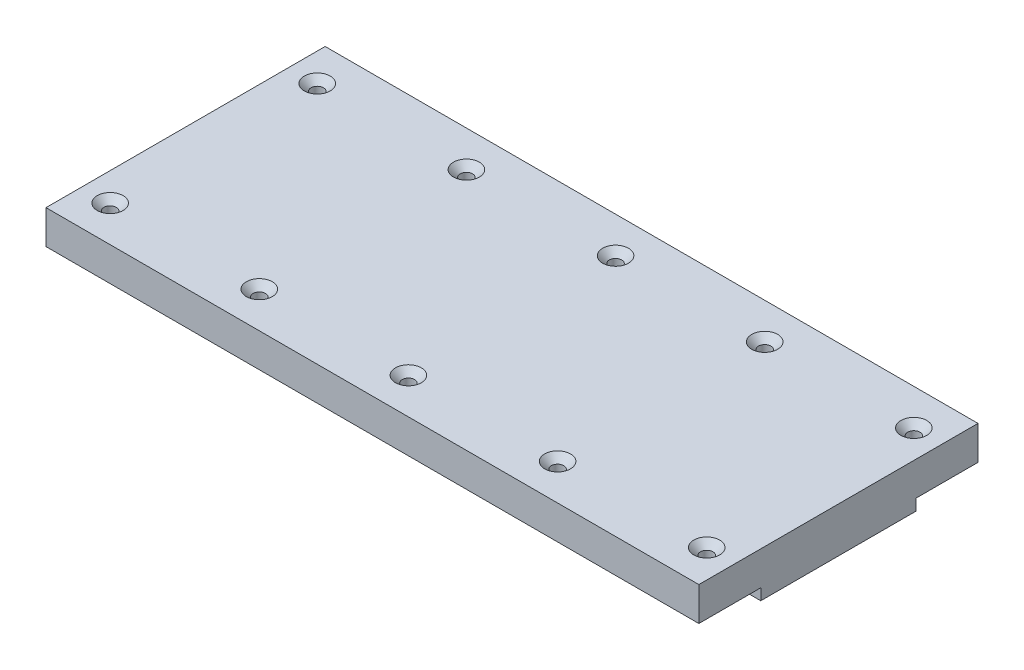
ISO-10303-21;
HEADER;
FILE_DESCRIPTION(('STEP AP214'),'2;1');
FILE_NAME('part.step','',(''),(''),'','','');
FILE_SCHEMA(('AUTOMOTIVE_DESIGN { 1 0 10303 214 1 1 1 1 }'));
ENDSEC;
DATA;
#1=APPLICATION_CONTEXT('core data for automotive mechanical design processes');
#2=APPLICATION_PROTOCOL_DEFINITION('international standard','automotive_design',2000,#1);
#3=PRODUCT_CONTEXT('',#1,'mechanical');
#4=PRODUCT('Part','Part','',(#3));
#5=PRODUCT_RELATED_PRODUCT_CATEGORY('part','',(#4));
#6=PRODUCT_DEFINITION_FORMATION('','',#4);
#7=PRODUCT_DEFINITION_CONTEXT('part definition',#1,'design');
#8=PRODUCT_DEFINITION('design','',#6,#7);
#9=PRODUCT_DEFINITION_SHAPE('','',#8);
#10=(LENGTH_UNIT() NAMED_UNIT(*) SI_UNIT(.MILLI.,.METRE.));
#11=(NAMED_UNIT(*) PLANE_ANGLE_UNIT() SI_UNIT($,.RADIAN.));
#12=(NAMED_UNIT(*) SI_UNIT($,.STERADIAN.) SOLID_ANGLE_UNIT());
#13=UNCERTAINTY_MEASURE_WITH_UNIT(LENGTH_MEASURE(1.E-05),#10,'distance_accuracy_value','');
#14=(GEOMETRIC_REPRESENTATION_CONTEXT(3) GLOBAL_UNCERTAINTY_ASSIGNED_CONTEXT((#13)) GLOBAL_UNIT_ASSIGNED_CONTEXT((#10,
#11,#12)) REPRESENTATION_CONTEXT('',''));
#15=CARTESIAN_POINT('',(0.,0.,0.));
#16=DIRECTION('',(0.,0.,1.));
#17=DIRECTION('',(1.,0.,0.));
#18=AXIS2_PLACEMENT_3D('',#15,#16,#17);
#19=CARTESIAN_POINT('',(-580.,0.,69.));
#20=DIRECTION('',(0.,0.,1.));
#21=DIRECTION('',(1.,0.,0.));
#22=AXIS2_PLACEMENT_3D('',#19,#20,#21);
#23=PLANE('',#22);
#24=DIRECTION('',(0.,-1.,0.));
#25=VECTOR('',#24,1.);
#26=CARTESIAN_POINT('',(0.,0.,69.));
#27=LINE('',#26,#25);
#28=CARTESIAN_POINT('',(0.,0.,69.));
#29=VERTEX_POINT('',#28);
#30=CARTESIAN_POINT('',(0.,-10.,69.));
#31=VERTEX_POINT('',#30);
#32=EDGE_CURVE('E136',#29,#31,#27,.T.);
#33=ORIENTED_EDGE('',*,*,#32,.F.);
#34=DIRECTION('',(1.,0.,0.));
#35=VECTOR('',#34,1.);
#36=CARTESIAN_POINT('',(-580.,0.,69.));
#37=LINE('',#36,#35);
#38=CARTESIAN_POINT('',(-580.,0.,69.));
#39=VERTEX_POINT('',#38);
#40=EDGE_CURVE('E53',#39,#29,#37,.T.);
#41=ORIENTED_EDGE('',*,*,#40,.F.);
#42=DIRECTION('',(0.,-1.,0.));
#43=VECTOR('',#42,1.);
#44=CARTESIAN_POINT('',(-580.,0.,69.));
#45=LINE('',#44,#43);
#46=CARTESIAN_POINT('',(-580.,-10.,69.));
#47=VERTEX_POINT('',#46);
#48=EDGE_CURVE('E158',#39,#47,#45,.T.);
#49=ORIENTED_EDGE('',*,*,#48,.T.);
#50=DIRECTION('',(1.,0.,0.));
#51=VECTOR('',#50,1.);
#52=CARTESIAN_POINT('',(-580.,-10.,69.));
#53=LINE('',#52,#51);
#54=EDGE_CURVE('E94',#47,#31,#53,.T.);
#55=ORIENTED_EDGE('',*,*,#54,.T.);
#56=EDGE_LOOP('',(#33,#41,#49,#55));
#57=FACE_BOUND('',#56,.T.);
#58=ADVANCED_FACE('F35',(#57),#23,.T.);
#59=CARTESIAN_POINT('',(-580.,0.,124.));
#60=DIRECTION('',(0.,-1.,0.));
#61=DIRECTION('',(0.,0.,-1.));
#62=AXIS2_PLACEMENT_3D('',#59,#60,#61);
#63=PLANE('',#62);
#64=CARTESIAN_POINT('',(-290.,0.,92.0000000000001));
#65=DIRECTION('',(0.,-1.,0.));
#66=DIRECTION('',(0.,0.,-1.));
#67=AXIS2_PLACEMENT_3D('',#64,#65,#66);
#68=CIRCLE('',#67,5.49999999999996);
#69=CARTESIAN_POINT('',(-290.,0.,86.5000000000001));
#70=VERTEX_POINT('',#69);
#71=EDGE_CURVE('E548',#70,#70,#68,.F.);
#72=ORIENTED_EDGE('',*,*,#71,.T.);
#73=EDGE_LOOP('',(#72));
#74=FACE_BOUND('',#73,.T.);
#75=CARTESIAN_POINT('',(-157.5,0.,92.0000000000001));
#76=DIRECTION('',(0.,-1.,0.));
#77=DIRECTION('',(0.,0.,-1.));
#78=AXIS2_PLACEMENT_3D('',#75,#76,#77);
#79=CIRCLE('',#78,5.49999999999996);
#80=CARTESIAN_POINT('',(-157.5,0.,86.5000000000001));
#81=VERTEX_POINT('',#80);
#82=EDGE_CURVE('E553',#81,#81,#79,.F.);
#83=ORIENTED_EDGE('',*,*,#82,.T.);
#84=EDGE_LOOP('',(#83));
#85=FACE_BOUND('',#84,.T.);
#86=CARTESIAN_POINT('',(-555.,0.,92.0000000000001));
#87=DIRECTION('',(0.,-1.,0.));
#88=DIRECTION('',(0.,0.,-1.));
#89=AXIS2_PLACEMENT_3D('',#86,#87,#88);
#90=CIRCLE('',#89,5.49999999999996);
#91=CARTESIAN_POINT('',(-555.,0.,86.5000000000001));
#92=VERTEX_POINT('',#91);
#93=EDGE_CURVE('E325',#92,#92,#90,.F.);
#94=ORIENTED_EDGE('',*,*,#93,.T.);
#95=EDGE_LOOP('',(#94));
#96=FACE_BOUND('',#95,.T.);
#97=CARTESIAN_POINT('',(-422.5,0.,92.0000000000001));
#98=DIRECTION('',(0.,-1.,0.));
#99=DIRECTION('',(0.,0.,-1.));
#100=AXIS2_PLACEMENT_3D('',#97,#98,#99);
#101=CIRCLE('',#100,5.49999999999996);
#102=CARTESIAN_POINT('',(-422.5,0.,86.5000000000001));
#103=VERTEX_POINT('',#102);
#104=EDGE_CURVE('E326',#103,#103,#101,.F.);
#105=ORIENTED_EDGE('',*,*,#104,.T.);
#106=EDGE_LOOP('',(#105));
#107=FACE_BOUND('',#106,.T.);
#108=CARTESIAN_POINT('',(-24.9999999999999,0.,92.0000000000001));
#109=DIRECTION('',(0.,-1.,0.));
#110=DIRECTION('',(0.,0.,-1.));
#111=AXIS2_PLACEMENT_3D('',#108,#109,#110);
#112=CIRCLE('',#111,5.49999999999996);
#113=CARTESIAN_POINT('',(-24.9999999999999,0.,86.5000000000001));
#114=VERTEX_POINT('',#113);
#115=EDGE_CURVE('E559',#114,#114,#112,.F.);
#116=ORIENTED_EDGE('',*,*,#115,.T.);
#117=EDGE_LOOP('',(#116));
#118=FACE_BOUND('',#117,.T.);
#119=DIRECTION('',(0.,0.,-1.));
#120=VECTOR('',#119,1.);
#121=CARTESIAN_POINT('',(0.,0.,124.));
#122=LINE('',#121,#120);
#123=CARTESIAN_POINT('',(0.,0.,124.));
#124=VERTEX_POINT('',#123);
#125=EDGE_CURVE('E155',#124,#29,#122,.T.);
#126=ORIENTED_EDGE('',*,*,#125,.F.);
#127=DIRECTION('',(1.,0.,0.));
#128=VECTOR('',#127,1.);
#129=CARTESIAN_POINT('',(-580.,0.,124.));
#130=LINE('',#129,#128);
#131=CARTESIAN_POINT('',(-580.,0.,124.));
#132=VERTEX_POINT('',#131);
#133=EDGE_CURVE('E82',#132,#124,#130,.T.);
#134=ORIENTED_EDGE('',*,*,#133,.F.);
#135=DIRECTION('',(0.,0.,-1.));
#136=VECTOR('',#135,1.);
#137=CARTESIAN_POINT('',(-580.,0.,124.));
#138=LINE('',#137,#136);
#139=EDGE_CURVE('E126',#132,#39,#138,.T.);
#140=ORIENTED_EDGE('',*,*,#139,.T.);
#141=ORIENTED_EDGE('',*,*,#40,.T.);
#142=EDGE_LOOP('',(#126,#134,#140,#141));
#143=FACE_BOUND('',#142,.T.);
#144=ADVANCED_FACE('F243',(#74,#85,#96,#107,#118,#143),#63,.T.);
#145=CARTESIAN_POINT('',(-580.,30.,124.));
#146=DIRECTION('',(0.,0.,1.));
#147=DIRECTION('',(1.,0.,0.));
#148=AXIS2_PLACEMENT_3D('',#145,#146,#147);
#149=PLANE('',#148);
#150=DIRECTION('',(0.,-1.,0.));
#151=VECTOR('',#150,1.);
#152=CARTESIAN_POINT('',(0.,30.,124.));
#153=LINE('',#152,#151);
#154=CARTESIAN_POINT('',(0.,30.,124.));
#155=VERTEX_POINT('',#154);
#156=EDGE_CURVE('E113',#155,#124,#153,.T.);
#157=ORIENTED_EDGE('',*,*,#156,.F.);
#158=DIRECTION('',(1.,0.,0.));
#159=VECTOR('',#158,1.);
#160=CARTESIAN_POINT('',(-580.,30.,124.));
#161=LINE('',#160,#159);
#162=CARTESIAN_POINT('',(-580.,30.,124.));
#163=VERTEX_POINT('',#162);
#164=EDGE_CURVE('E108',#163,#155,#161,.T.);
#165=ORIENTED_EDGE('',*,*,#164,.F.);
#166=DIRECTION('',(0.,-1.,0.));
#167=VECTOR('',#166,1.);
#168=CARTESIAN_POINT('',(-580.,30.,124.));
#169=LINE('',#168,#167);
#170=EDGE_CURVE('E111',#163,#132,#169,.T.);
#171=ORIENTED_EDGE('',*,*,#170,.T.);
#172=ORIENTED_EDGE('',*,*,#133,.T.);
#173=EDGE_LOOP('',(#157,#165,#171,#172));
#174=FACE_BOUND('',#173,.T.);
#175=ADVANCED_FACE('F110',(#174),#149,.T.);
#176=CARTESIAN_POINT('',(-580.,30.,-124.));
#177=DIRECTION('',(0.,1.,0.));
#178=DIRECTION('',(0.,0.,1.));
#179=AXIS2_PLACEMENT_3D('',#176,#177,#178);
#180=PLANE('',#179);
#181=CARTESIAN_POINT('',(-24.9999999999999,30.,92.0000000000001));
#182=DIRECTION('',(0.,1.,0.));
#183=DIRECTION('',(0.,0.,1.));
#184=AXIS2_PLACEMENT_3D('',#181,#182,#183);
#185=CIRCLE('',#184,11.5000000000001);
#186=CARTESIAN_POINT('',(-24.9999999999999,30.,103.5));
#187=VERTEX_POINT('',#186);
#188=EDGE_CURVE('E199',#187,#187,#185,.F.);
#189=ORIENTED_EDGE('',*,*,#188,.T.);
#190=EDGE_LOOP('',(#189));
#191=FACE_BOUND('',#190,.T.);
#192=CARTESIAN_POINT('',(-24.9999999999999,30.,-91.9999999999999));
#193=DIRECTION('',(0.,1.,0.));
#194=DIRECTION('',(0.,0.,1.));
#195=AXIS2_PLACEMENT_3D('',#192,#193,#194);
#196=CIRCLE('',#195,11.5000000000001);
#197=CARTESIAN_POINT('',(-24.9999999999999,30.,-80.4999999999998));
#198=VERTEX_POINT('',#197);
#199=EDGE_CURVE('E196',#198,#198,#196,.F.);
#200=ORIENTED_EDGE('',*,*,#199,.T.);
#201=EDGE_LOOP('',(#200));
#202=FACE_BOUND('',#201,.T.);
#203=CARTESIAN_POINT('',(-157.5,30.,-91.9999999999999));
#204=DIRECTION('',(0.,1.,0.));
#205=DIRECTION('',(0.,0.,1.));
#206=AXIS2_PLACEMENT_3D('',#203,#204,#205);
#207=CIRCLE('',#206,11.5000000000001);
#208=CARTESIAN_POINT('',(-157.5,30.,-80.4999999999998));
#209=VERTEX_POINT('',#208);
#210=EDGE_CURVE('E193',#209,#209,#207,.F.);
#211=ORIENTED_EDGE('',*,*,#210,.T.);
#212=EDGE_LOOP('',(#211));
#213=FACE_BOUND('',#212,.T.);
#214=CARTESIAN_POINT('',(-157.5,30.,92.0000000000001));
#215=DIRECTION('',(0.,1.,0.));
#216=DIRECTION('',(0.,0.,1.));
#217=AXIS2_PLACEMENT_3D('',#214,#215,#216);
#218=CIRCLE('',#217,11.5000000000001);
#219=CARTESIAN_POINT('',(-157.5,30.,103.5));
#220=VERTEX_POINT('',#219);
#221=EDGE_CURVE('E190',#220,#220,#218,.F.);
#222=ORIENTED_EDGE('',*,*,#221,.T.);
#223=EDGE_LOOP('',(#222));
#224=FACE_BOUND('',#223,.T.);
#225=CARTESIAN_POINT('',(-290.,30.,-91.9999999999999));
#226=DIRECTION('',(0.,1.,0.));
#227=DIRECTION('',(0.,0.,1.));
#228=AXIS2_PLACEMENT_3D('',#225,#226,#227);
#229=CIRCLE('',#228,11.5000000000001);
#230=CARTESIAN_POINT('',(-290.,30.,-80.4999999999998));
#231=VERTEX_POINT('',#230);
#232=EDGE_CURVE('E187',#231,#231,#229,.F.);
#233=ORIENTED_EDGE('',*,*,#232,.T.);
#234=EDGE_LOOP('',(#233));
#235=FACE_BOUND('',#234,.T.);
#236=CARTESIAN_POINT('',(-290.,30.,92.0000000000001));
#237=DIRECTION('',(0.,1.,0.));
#238=DIRECTION('',(0.,0.,1.));
#239=AXIS2_PLACEMENT_3D('',#236,#237,#238);
#240=CIRCLE('',#239,11.5000000000001);
#241=CARTESIAN_POINT('',(-290.,30.,103.5));
#242=VERTEX_POINT('',#241);
#243=EDGE_CURVE('E184',#242,#242,#240,.F.);
#244=ORIENTED_EDGE('',*,*,#243,.T.);
#245=EDGE_LOOP('',(#244));
#246=FACE_BOUND('',#245,.T.);
#247=CARTESIAN_POINT('',(-422.5,30.,-91.9999999999999));
#248=DIRECTION('',(0.,1.,0.));
#249=DIRECTION('',(0.,0.,1.));
#250=AXIS2_PLACEMENT_3D('',#247,#248,#249);
#251=CIRCLE('',#250,11.5000000000001);
#252=CARTESIAN_POINT('',(-422.5,30.,-80.4999999999998));
#253=VERTEX_POINT('',#252);
#254=EDGE_CURVE('E181',#253,#253,#251,.F.);
#255=ORIENTED_EDGE('',*,*,#254,.T.);
#256=EDGE_LOOP('',(#255));
#257=FACE_BOUND('',#256,.T.);
#258=CARTESIAN_POINT('',(-555.,30.,-91.9999999999999));
#259=DIRECTION('',(0.,1.,0.));
#260=DIRECTION('',(0.,0.,1.));
#261=AXIS2_PLACEMENT_3D('',#258,#259,#260);
#262=CIRCLE('',#261,11.5000000000001);
#263=CARTESIAN_POINT('',(-555.,30.,-80.4999999999998));
#264=VERTEX_POINT('',#263);
#265=EDGE_CURVE('E178',#264,#264,#262,.F.);
#266=ORIENTED_EDGE('',*,*,#265,.T.);
#267=EDGE_LOOP('',(#266));
#268=FACE_BOUND('',#267,.T.);
#269=CARTESIAN_POINT('',(-555.,30.,92.0000000000001));
#270=DIRECTION('',(0.,1.,0.));
#271=DIRECTION('',(0.,0.,1.));
#272=AXIS2_PLACEMENT_3D('',#269,#270,#271);
#273=CIRCLE('',#272,11.5000000000001);
#274=CARTESIAN_POINT('',(-555.,30.,103.5));
#275=VERTEX_POINT('',#274);
#276=EDGE_CURVE('E175',#275,#275,#273,.F.);
#277=ORIENTED_EDGE('',*,*,#276,.T.);
#278=EDGE_LOOP('',(#277));
#279=FACE_BOUND('',#278,.T.);
#280=CARTESIAN_POINT('',(-422.5,30.,92.0000000000001));
#281=DIRECTION('',(0.,1.,0.));
#282=DIRECTION('',(0.,0.,1.));
#283=AXIS2_PLACEMENT_3D('',#280,#281,#282);
#284=CIRCLE('',#283,11.5000000000001);
#285=CARTESIAN_POINT('',(-422.5,30.,103.5));
#286=VERTEX_POINT('',#285);
#287=EDGE_CURVE('E172',#286,#286,#284,.F.);
#288=ORIENTED_EDGE('',*,*,#287,.T.);
#289=EDGE_LOOP('',(#288));
#290=FACE_BOUND('',#289,.T.);
#291=DIRECTION('',(0.,0.,1.));
#292=VECTOR('',#291,1.);
#293=CARTESIAN_POINT('',(0.,30.,-124.));
#294=LINE('',#293,#292);
#295=CARTESIAN_POINT('',(0.,30.,-124.));
#296=VERTEX_POINT('',#295);
#297=EDGE_CURVE('E152',#296,#155,#294,.T.);
#298=ORIENTED_EDGE('',*,*,#297,.F.);
#299=DIRECTION('',(1.,0.,0.));
#300=VECTOR('',#299,1.);
#301=CARTESIAN_POINT('',(-580.,30.,-124.));
#302=LINE('',#301,#300);
#303=CARTESIAN_POINT('',(-580.,30.,-124.));
#304=VERTEX_POINT('',#303);
#305=EDGE_CURVE('E118',#304,#296,#302,.T.);
#306=ORIENTED_EDGE('',*,*,#305,.F.);
#307=DIRECTION('',(0.,0.,1.));
#308=VECTOR('',#307,1.);
#309=CARTESIAN_POINT('',(-580.,30.,-124.));
#310=LINE('',#309,#308);
#311=EDGE_CURVE('E124',#304,#163,#310,.T.);
#312=ORIENTED_EDGE('',*,*,#311,.T.);
#313=ORIENTED_EDGE('',*,*,#164,.T.);
#314=EDGE_LOOP('',(#298,#306,#312,#313));
#315=FACE_BOUND('',#314,.T.);
#316=ADVANCED_FACE('F128',(#191,#202,#213,#224,#235,#246,#257,#268,#279,#290,#315),#180,.T.);
#317=CARTESIAN_POINT('',(-580.,0.,-124.));
#318=DIRECTION('',(0.,0.,-1.));
#319=DIRECTION('',(-1.,0.,0.));
#320=AXIS2_PLACEMENT_3D('',#317,#318,#319);
#321=PLANE('',#320);
#322=DIRECTION('',(0.,1.,0.));
#323=VECTOR('',#322,1.);
#324=CARTESIAN_POINT('',(0.,0.,-124.));
#325=LINE('',#324,#323);
#326=CARTESIAN_POINT('',(0.,0.,-124.));
#327=VERTEX_POINT('',#326);
#328=EDGE_CURVE('E149',#327,#296,#325,.T.);
#329=ORIENTED_EDGE('',*,*,#328,.F.);
#330=DIRECTION('',(1.,0.,0.));
#331=VECTOR('',#330,1.);
#332=CARTESIAN_POINT('',(-580.,0.,-124.));
#333=LINE('',#332,#331);
#334=CARTESIAN_POINT('',(-580.,0.,-124.));
#335=VERTEX_POINT('',#334);
#336=EDGE_CURVE('E163',#335,#327,#333,.T.);
#337=ORIENTED_EDGE('',*,*,#336,.F.);
#338=DIRECTION('',(0.,1.,0.));
#339=VECTOR('',#338,1.);
#340=CARTESIAN_POINT('',(-580.,0.,-124.));
#341=LINE('',#340,#339);
#342=EDGE_CURVE('E129',#335,#304,#341,.T.);
#343=ORIENTED_EDGE('',*,*,#342,.T.);
#344=ORIENTED_EDGE('',*,*,#305,.T.);
#345=EDGE_LOOP('',(#329,#337,#343,#344));
#346=FACE_BOUND('',#345,.T.);
#347=ADVANCED_FACE('F355',(#346),#321,.T.);
#348=CARTESIAN_POINT('',(-580.,0.,-69.));
#349=DIRECTION('',(0.,-1.,0.));
#350=DIRECTION('',(0.,0.,-1.));
#351=AXIS2_PLACEMENT_3D('',#348,#349,#350);
#352=PLANE('',#351);
#353=CARTESIAN_POINT('',(-157.5,0.,-91.9999999999999));
#354=DIRECTION('',(0.,-1.,0.));
#355=DIRECTION('',(0.,0.,-1.));
#356=AXIS2_PLACEMENT_3D('',#353,#354,#355);
#357=CIRCLE('',#356,5.49999999999996);
#358=CARTESIAN_POINT('',(-157.5,0.,-97.4999999999999));
#359=VERTEX_POINT('',#358);
#360=EDGE_CURVE('E549',#359,#359,#357,.F.);
#361=ORIENTED_EDGE('',*,*,#360,.T.);
#362=EDGE_LOOP('',(#361));
#363=FACE_BOUND('',#362,.T.);
#364=CARTESIAN_POINT('',(-24.9999999999999,0.,-91.9999999999999));
#365=DIRECTION('',(0.,-1.,0.));
#366=DIRECTION('',(0.,0.,-1.));
#367=AXIS2_PLACEMENT_3D('',#364,#365,#366);
#368=CIRCLE('',#367,5.49999999999996);
#369=CARTESIAN_POINT('',(-24.9999999999999,0.,-97.4999999999999));
#370=VERTEX_POINT('',#369);
#371=EDGE_CURVE('E556',#370,#370,#368,.F.);
#372=ORIENTED_EDGE('',*,*,#371,.T.);
#373=EDGE_LOOP('',(#372));
#374=FACE_BOUND('',#373,.T.);
#375=CARTESIAN_POINT('',(-422.5,0.,-91.9999999999999));
#376=DIRECTION('',(0.,-1.,0.));
#377=DIRECTION('',(0.,0.,-1.));
#378=AXIS2_PLACEMENT_3D('',#375,#376,#377);
#379=CIRCLE('',#378,5.49999999999996);
#380=CARTESIAN_POINT('',(-422.5,0.,-97.4999999999999));
#381=VERTEX_POINT('',#380);
#382=EDGE_CURVE('E323',#381,#381,#379,.F.);
#383=ORIENTED_EDGE('',*,*,#382,.T.);
#384=EDGE_LOOP('',(#383));
#385=FACE_BOUND('',#384,.T.);
#386=CARTESIAN_POINT('',(-290.,0.,-91.9999999999999));
#387=DIRECTION('',(0.,-1.,0.));
#388=DIRECTION('',(0.,0.,-1.));
#389=AXIS2_PLACEMENT_3D('',#386,#387,#388);
#390=CIRCLE('',#389,5.49999999999996);
#391=CARTESIAN_POINT('',(-290.,0.,-97.4999999999999));
#392=VERTEX_POINT('',#391);
#393=EDGE_CURVE('E331',#392,#392,#390,.F.);
#394=ORIENTED_EDGE('',*,*,#393,.T.);
#395=EDGE_LOOP('',(#394));
#396=FACE_BOUND('',#395,.T.);
#397=CARTESIAN_POINT('',(-555.,0.,-91.9999999999999));
#398=DIRECTION('',(0.,-1.,0.));
#399=DIRECTION('',(0.,0.,-1.));
#400=AXIS2_PLACEMENT_3D('',#397,#398,#399);
#401=CIRCLE('',#400,5.49999999999996);
#402=CARTESIAN_POINT('',(-555.,0.,-97.4999999999999));
#403=VERTEX_POINT('',#402);
#404=EDGE_CURVE('E140',#403,#403,#401,.F.);
#405=ORIENTED_EDGE('',*,*,#404,.T.);
#406=EDGE_LOOP('',(#405));
#407=FACE_BOUND('',#406,.T.);
#408=DIRECTION('',(0.,0.,-1.));
#409=VECTOR('',#408,1.);
#410=CARTESIAN_POINT('',(0.,0.,-69.));
#411=LINE('',#410,#409);
#412=CARTESIAN_POINT('',(0.,0.,-69.));
#413=VERTEX_POINT('',#412);
#414=EDGE_CURVE('E146',#413,#327,#411,.T.);
#415=ORIENTED_EDGE('',*,*,#414,.F.);
#416=DIRECTION('',(1.,0.,0.));
#417=VECTOR('',#416,1.);
#418=CARTESIAN_POINT('',(-580.,0.,-69.));
#419=LINE('',#418,#417);
#420=CARTESIAN_POINT('',(-580.,0.,-69.));
#421=VERTEX_POINT('',#420);
#422=EDGE_CURVE('E165',#421,#413,#419,.T.);
#423=ORIENTED_EDGE('',*,*,#422,.F.);
#424=DIRECTION('',(0.,0.,-1.));
#425=VECTOR('',#424,1.);
#426=CARTESIAN_POINT('',(-580.,0.,-69.));
#427=LINE('',#426,#425);
#428=EDGE_CURVE('E131',#421,#335,#427,.T.);
#429=ORIENTED_EDGE('',*,*,#428,.T.);
#430=ORIENTED_EDGE('',*,*,#336,.T.);
#431=EDGE_LOOP('',(#415,#423,#429,#430));
#432=FACE_BOUND('',#431,.T.);
#433=ADVANCED_FACE('F346',(#363,#374,#385,#396,#407,#432),#352,.T.);
#434=CARTESIAN_POINT('',(-580.,-10.,-69.));
#435=DIRECTION('',(0.,0.,-1.));
#436=DIRECTION('',(-1.,0.,0.));
#437=AXIS2_PLACEMENT_3D('',#434,#435,#436);
#438=PLANE('',#437);
#439=DIRECTION('',(0.,1.,0.));
#440=VECTOR('',#439,1.);
#441=CARTESIAN_POINT('',(0.,-10.,-69.));
#442=LINE('',#441,#440);
#443=CARTESIAN_POINT('',(0.,-10.,-69.));
#444=VERTEX_POINT('',#443);
#445=EDGE_CURVE('E143',#444,#413,#442,.T.);
#446=ORIENTED_EDGE('',*,*,#445,.F.);
#447=DIRECTION('',(1.,0.,0.));
#448=VECTOR('',#447,1.);
#449=CARTESIAN_POINT('',(-580.,-10.,-69.));
#450=LINE('',#449,#448);
#451=CARTESIAN_POINT('',(-580.,-10.,-69.));
#452=VERTEX_POINT('',#451);
#453=EDGE_CURVE('E167',#452,#444,#450,.T.);
#454=ORIENTED_EDGE('',*,*,#453,.F.);
#455=DIRECTION('',(0.,1.,0.));
#456=VECTOR('',#455,1.);
#457=CARTESIAN_POINT('',(-580.,-10.,-69.));
#458=LINE('',#457,#456);
#459=EDGE_CURVE('E340',#452,#421,#458,.T.);
#460=ORIENTED_EDGE('',*,*,#459,.T.);
#461=ORIENTED_EDGE('',*,*,#422,.T.);
#462=EDGE_LOOP('',(#446,#454,#460,#461));
#463=FACE_BOUND('',#462,.T.);
#464=ADVANCED_FACE('F351',(#463),#438,.T.);
#465=CARTESIAN_POINT('',(-580.,-10.,69.));
#466=DIRECTION('',(0.,-1.,0.));
#467=DIRECTION('',(0.,0.,-1.));
#468=AXIS2_PLACEMENT_3D('',#465,#466,#467);
#469=PLANE('',#468);
#470=DIRECTION('',(0.,0.,-1.));
#471=VECTOR('',#470,1.);
#472=CARTESIAN_POINT('',(0.,-10.,69.));
#473=LINE('',#472,#471);
#474=EDGE_CURVE('E139',#31,#444,#473,.T.);
#475=ORIENTED_EDGE('',*,*,#474,.F.);
#476=ORIENTED_EDGE('',*,*,#54,.F.);
#477=DIRECTION('',(0.,0.,-1.));
#478=VECTOR('',#477,1.);
#479=CARTESIAN_POINT('',(-580.,-10.,69.));
#480=LINE('',#479,#478);
#481=EDGE_CURVE('E338',#47,#452,#480,.T.);
#482=ORIENTED_EDGE('',*,*,#481,.T.);
#483=ORIENTED_EDGE('',*,*,#453,.T.);
#484=EDGE_LOOP('',(#475,#476,#482,#483));
#485=FACE_BOUND('',#484,.T.);
#486=ADVANCED_FACE('F252',(#485),#469,.T.);
#487=CARTESIAN_POINT('',(-580.,0.,0.));
#488=DIRECTION('',(1.,0.,0.));
#489=DIRECTION('',(0.,0.,-1.));
#490=AXIS2_PLACEMENT_3D('',#487,#488,#489);
#491=PLANE('',#490);
#492=ORIENTED_EDGE('',*,*,#48,.F.);
#493=ORIENTED_EDGE('',*,*,#139,.F.);
#494=ORIENTED_EDGE('',*,*,#170,.F.);
#495=ORIENTED_EDGE('',*,*,#311,.F.);
#496=ORIENTED_EDGE('',*,*,#342,.F.);
#497=ORIENTED_EDGE('',*,*,#428,.F.);
#498=ORIENTED_EDGE('',*,*,#459,.F.);
#499=ORIENTED_EDGE('',*,*,#481,.F.);
#500=EDGE_LOOP('',(#492,#493,#494,#495,#496,#497,#498,#499));
#501=FACE_BOUND('',#500,.T.);
#502=ADVANCED_FACE('F122',(#501),#491,.F.);
#503=CARTESIAN_POINT('',(0.,0.,0.));
#504=DIRECTION('',(1.,0.,0.));
#505=DIRECTION('',(0.,0.,-1.));
#506=AXIS2_PLACEMENT_3D('',#503,#504,#505);
#507=PLANE('',#506);
#508=ORIENTED_EDGE('',*,*,#32,.T.);
#509=ORIENTED_EDGE('',*,*,#474,.T.);
#510=ORIENTED_EDGE('',*,*,#445,.T.);
#511=ORIENTED_EDGE('',*,*,#414,.T.);
#512=ORIENTED_EDGE('',*,*,#328,.T.);
#513=ORIENTED_EDGE('',*,*,#297,.T.);
#514=ORIENTED_EDGE('',*,*,#156,.T.);
#515=ORIENTED_EDGE('',*,*,#125,.T.);
#516=EDGE_LOOP('',(#508,#509,#510,#511,#512,#513,#514,#515));
#517=FACE_BOUND('',#516,.T.);
#518=ADVANCED_FACE('F353',(#517),#507,.T.);
#519=CARTESIAN_POINT('',(-555.,-10.001,-91.9999999999999));
#520=DIRECTION('',(0.,1.,0.));
#521=DIRECTION('',(0.,0.,1.));
#522=AXIS2_PLACEMENT_3D('',#519,#520,#521);
#523=CYLINDRICAL_SURFACE('',#522,5.49999999999996);
#524=CARTESIAN_POINT('',(-555.,23.9999999999998,-91.9999999999999));
#525=DIRECTION('',(0.,1.,0.));
#526=DIRECTION('',(0.,0.,1.));
#527=AXIS2_PLACEMENT_3D('',#524,#525,#526);
#528=CIRCLE('',#527,5.49999999999996);
#529=CARTESIAN_POINT('',(-555.,23.9999999999998,-86.5));
#530=VERTEX_POINT('',#529);
#531=EDGE_CURVE('E220',#530,#530,#528,.T.);
#532=ORIENTED_EDGE('',*,*,#531,.T.);
#533=EDGE_LOOP('',(#532));
#534=FACE_BOUND('',#533,.T.);
#535=ORIENTED_EDGE('',*,*,#404,.F.);
#536=EDGE_LOOP('',(#535));
#537=FACE_BOUND('',#536,.T.);
#538=ADVANCED_FACE('F378',(#534,#537),#523,.F.);
#539=CARTESIAN_POINT('',(-290.,-10.001,-91.9999999999999));
#540=DIRECTION('',(0.,1.,0.));
#541=DIRECTION('',(0.,0.,1.));
#542=AXIS2_PLACEMENT_3D('',#539,#540,#541);
#543=CYLINDRICAL_SURFACE('',#542,5.49999999999996);
#544=CARTESIAN_POINT('',(-290.,23.9999999999998,-91.9999999999999));
#545=DIRECTION('',(0.,1.,0.));
#546=DIRECTION('',(0.,0.,1.));
#547=AXIS2_PLACEMENT_3D('',#544,#545,#546);
#548=CIRCLE('',#547,5.49999999999996);
#549=CARTESIAN_POINT('',(-290.,23.9999999999998,-86.5));
#550=VERTEX_POINT('',#549);
#551=EDGE_CURVE('E211',#550,#550,#548,.T.);
#552=ORIENTED_EDGE('',*,*,#551,.T.);
#553=EDGE_LOOP('',(#552));
#554=FACE_BOUND('',#553,.T.);
#555=ORIENTED_EDGE('',*,*,#393,.F.);
#556=EDGE_LOOP('',(#555));
#557=FACE_BOUND('',#556,.T.);
#558=ADVANCED_FACE('F319',(#554,#557),#543,.F.);
#559=CARTESIAN_POINT('',(-422.5,-10.001,-91.9999999999999));
#560=DIRECTION('',(0.,1.,0.));
#561=DIRECTION('',(0.,0.,1.));
#562=AXIS2_PLACEMENT_3D('',#559,#560,#561);
#563=CYLINDRICAL_SURFACE('',#562,5.49999999999996);
#564=CARTESIAN_POINT('',(-422.5,23.9999999999998,-91.9999999999999));
#565=DIRECTION('',(0.,1.,0.));
#566=DIRECTION('',(0.,0.,1.));
#567=AXIS2_PLACEMENT_3D('',#564,#565,#566);
#568=CIRCLE('',#567,5.49999999999996);
#569=CARTESIAN_POINT('',(-422.5,23.9999999999998,-86.5));
#570=VERTEX_POINT('',#569);
#571=EDGE_CURVE('E217',#570,#570,#568,.T.);
#572=ORIENTED_EDGE('',*,*,#571,.T.);
#573=EDGE_LOOP('',(#572));
#574=FACE_BOUND('',#573,.T.);
#575=ORIENTED_EDGE('',*,*,#382,.F.);
#576=EDGE_LOOP('',(#575));
#577=FACE_BOUND('',#576,.T.);
#578=ADVANCED_FACE('F315',(#574,#577),#563,.F.);
#579=CARTESIAN_POINT('',(-24.9999999999999,-10.001,-91.9999999999999));
#580=DIRECTION('',(0.,1.,0.));
#581=DIRECTION('',(0.,0.,1.));
#582=AXIS2_PLACEMENT_3D('',#579,#580,#581);
#583=CYLINDRICAL_SURFACE('',#582,5.49999999999996);
#584=CARTESIAN_POINT('',(-24.9999999999999,23.9999999999998,-91.9999999999999));
#585=DIRECTION('',(0.,1.,0.));
#586=DIRECTION('',(0.,0.,1.));
#587=AXIS2_PLACEMENT_3D('',#584,#585,#586);
#588=CIRCLE('',#587,5.49999999999996);
#589=CARTESIAN_POINT('',(-24.9999999999999,23.9999999999998,-86.5));
#590=VERTEX_POINT('',#589);
#591=EDGE_CURVE('E202',#590,#590,#588,.T.);
#592=ORIENTED_EDGE('',*,*,#591,.T.);
#593=EDGE_LOOP('',(#592));
#594=FACE_BOUND('',#593,.T.);
#595=ORIENTED_EDGE('',*,*,#371,.F.);
#596=EDGE_LOOP('',(#595));
#597=FACE_BOUND('',#596,.T.);
#598=ADVANCED_FACE('F318',(#594,#597),#583,.F.);
#599=CARTESIAN_POINT('',(-157.5,-10.001,-91.9999999999999));
#600=DIRECTION('',(0.,1.,0.));
#601=DIRECTION('',(0.,0.,1.));
#602=AXIS2_PLACEMENT_3D('',#599,#600,#601);
#603=CYLINDRICAL_SURFACE('',#602,5.49999999999996);
#604=CARTESIAN_POINT('',(-157.5,23.9999999999998,-91.9999999999999));
#605=DIRECTION('',(0.,1.,0.));
#606=DIRECTION('',(0.,0.,1.));
#607=AXIS2_PLACEMENT_3D('',#604,#605,#606);
#608=CIRCLE('',#607,5.49999999999996);
#609=CARTESIAN_POINT('',(-157.5,23.9999999999998,-86.5));
#610=VERTEX_POINT('',#609);
#611=EDGE_CURVE('E205',#610,#610,#608,.T.);
#612=ORIENTED_EDGE('',*,*,#611,.T.);
#613=EDGE_LOOP('',(#612));
#614=FACE_BOUND('',#613,.T.);
#615=ORIENTED_EDGE('',*,*,#360,.F.);
#616=EDGE_LOOP('',(#615));
#617=FACE_BOUND('',#616,.T.);
#618=ADVANCED_FACE('F427',(#614,#617),#603,.F.);
#619=CARTESIAN_POINT('',(-24.9999999999999,-10.001,92.0000000000001));
#620=DIRECTION('',(0.,1.,0.));
#621=DIRECTION('',(0.,0.,1.));
#622=AXIS2_PLACEMENT_3D('',#619,#620,#621);
#623=CYLINDRICAL_SURFACE('',#622,5.49999999999996);
#624=CARTESIAN_POINT('',(-24.9999999999999,23.9999999999998,92.0000000000001));
#625=DIRECTION('',(0.,1.,0.));
#626=DIRECTION('',(0.,0.,1.));
#627=AXIS2_PLACEMENT_3D('',#624,#625,#626);
#628=CIRCLE('',#627,5.49999999999996);
#629=CARTESIAN_POINT('',(-24.9999999999999,23.9999999999998,97.5));
#630=VERTEX_POINT('',#629);
#631=EDGE_CURVE('E160',#630,#630,#628,.T.);
#632=ORIENTED_EDGE('',*,*,#631,.T.);
#633=EDGE_LOOP('',(#632));
#634=FACE_BOUND('',#633,.T.);
#635=ORIENTED_EDGE('',*,*,#115,.F.);
#636=EDGE_LOOP('',(#635));
#637=FACE_BOUND('',#636,.T.);
#638=ADVANCED_FACE('F437',(#634,#637),#623,.F.);
#639=CARTESIAN_POINT('',(-422.5,-10.001,92.0000000000001));
#640=DIRECTION('',(0.,1.,0.));
#641=DIRECTION('',(0.,0.,1.));
#642=AXIS2_PLACEMENT_3D('',#639,#640,#641);
#643=CYLINDRICAL_SURFACE('',#642,5.49999999999996);
#644=CARTESIAN_POINT('',(-422.5,23.9999999999998,92.0000000000001));
#645=DIRECTION('',(0.,1.,0.));
#646=DIRECTION('',(0.,0.,1.));
#647=AXIS2_PLACEMENT_3D('',#644,#645,#646);
#648=CIRCLE('',#647,5.49999999999996);
#649=CARTESIAN_POINT('',(-422.5,23.9999999999998,97.5));
#650=VERTEX_POINT('',#649);
#651=EDGE_CURVE('E11',#650,#650,#648,.T.);
#652=ORIENTED_EDGE('',*,*,#651,.T.);
#653=EDGE_LOOP('',(#652));
#654=FACE_BOUND('',#653,.T.);
#655=ORIENTED_EDGE('',*,*,#104,.F.);
#656=EDGE_LOOP('',(#655));
#657=FACE_BOUND('',#656,.T.);
#658=ADVANCED_FACE('F447',(#654,#657),#643,.F.);
#659=CARTESIAN_POINT('',(-555.,-10.001,92.0000000000001));
#660=DIRECTION('',(0.,1.,0.));
#661=DIRECTION('',(0.,0.,1.));
#662=AXIS2_PLACEMENT_3D('',#659,#660,#661);
#663=CYLINDRICAL_SURFACE('',#662,5.49999999999996);
#664=CARTESIAN_POINT('',(-555.,23.9999999999998,92.0000000000001));
#665=DIRECTION('',(0.,1.,0.));
#666=DIRECTION('',(0.,0.,1.));
#667=AXIS2_PLACEMENT_3D('',#664,#665,#666);
#668=CIRCLE('',#667,5.49999999999996);
#669=CARTESIAN_POINT('',(-555.,23.9999999999998,97.5));
#670=VERTEX_POINT('',#669);
#671=EDGE_CURVE('E45',#670,#670,#668,.T.);
#672=ORIENTED_EDGE('',*,*,#671,.T.);
#673=EDGE_LOOP('',(#672));
#674=FACE_BOUND('',#673,.T.);
#675=ORIENTED_EDGE('',*,*,#93,.F.);
#676=EDGE_LOOP('',(#675));
#677=FACE_BOUND('',#676,.T.);
#678=ADVANCED_FACE('F225',(#674,#677),#663,.F.);
#679=CARTESIAN_POINT('',(-157.5,-10.001,92.0000000000001));
#680=DIRECTION('',(0.,1.,0.));
#681=DIRECTION('',(0.,0.,1.));
#682=AXIS2_PLACEMENT_3D('',#679,#680,#681);
#683=CYLINDRICAL_SURFACE('',#682,5.49999999999996);
#684=CARTESIAN_POINT('',(-157.5,23.9999999999998,92.0000000000001));
#685=DIRECTION('',(0.,1.,0.));
#686=DIRECTION('',(0.,0.,1.));
#687=AXIS2_PLACEMENT_3D('',#684,#685,#686);
#688=CIRCLE('',#687,5.49999999999996);
#689=CARTESIAN_POINT('',(-157.5,23.9999999999998,97.5));
#690=VERTEX_POINT('',#689);
#691=EDGE_CURVE('E208',#690,#690,#688,.T.);
#692=ORIENTED_EDGE('',*,*,#691,.T.);
#693=EDGE_LOOP('',(#692));
#694=FACE_BOUND('',#693,.T.);
#695=ORIENTED_EDGE('',*,*,#82,.F.);
#696=EDGE_LOOP('',(#695));
#697=FACE_BOUND('',#696,.T.);
#698=ADVANCED_FACE('F466',(#694,#697),#683,.F.);
#699=CARTESIAN_POINT('',(-290.,-10.001,92.0000000000001));
#700=DIRECTION('',(0.,1.,0.));
#701=DIRECTION('',(0.,0.,1.));
#702=AXIS2_PLACEMENT_3D('',#699,#700,#701);
#703=CYLINDRICAL_SURFACE('',#702,5.49999999999996);
#704=CARTESIAN_POINT('',(-290.,23.9999999999998,92.0000000000001));
#705=DIRECTION('',(0.,1.,0.));
#706=DIRECTION('',(0.,0.,1.));
#707=AXIS2_PLACEMENT_3D('',#704,#705,#706);
#708=CIRCLE('',#707,5.49999999999996);
#709=CARTESIAN_POINT('',(-290.,23.9999999999998,97.5));
#710=VERTEX_POINT('',#709);
#711=EDGE_CURVE('E214',#710,#710,#708,.T.);
#712=ORIENTED_EDGE('',*,*,#711,.T.);
#713=EDGE_LOOP('',(#712));
#714=FACE_BOUND('',#713,.T.);
#715=ORIENTED_EDGE('',*,*,#71,.F.);
#716=EDGE_LOOP('',(#715));
#717=FACE_BOUND('',#716,.T.);
#718=ADVANCED_FACE('F262',(#714,#717),#703,.F.);
#719=CARTESIAN_POINT('',(-24.9999999999999,23.9999999999998,92.0000000000001));
#720=DIRECTION('',(0.,1.,0.));
#721=DIRECTION('',(0.,0.,1.));
#722=AXIS2_PLACEMENT_3D('',#719,#720,#721);
#723=CONICAL_SURFACE('',#722,5.49999999999996,0.785398163397451);
#724=ORIENTED_EDGE('',*,*,#188,.F.);
#725=EDGE_LOOP('',(#724));
#726=FACE_BOUND('',#725,.T.);
#727=ORIENTED_EDGE('',*,*,#631,.F.);
#728=EDGE_LOOP('',(#727));
#729=FACE_BOUND('',#728,.T.);
#730=ADVANCED_FACE('F255',(#726,#729),#723,.F.);
#731=CARTESIAN_POINT('',(-24.9999999999999,23.9999999999998,-91.9999999999999));
#732=DIRECTION('',(0.,1.,0.));
#733=DIRECTION('',(0.,0.,1.));
#734=AXIS2_PLACEMENT_3D('',#731,#732,#733);
#735=CONICAL_SURFACE('',#734,5.49999999999996,0.785398163397451);
#736=ORIENTED_EDGE('',*,*,#199,.F.);
#737=EDGE_LOOP('',(#736));
#738=FACE_BOUND('',#737,.T.);
#739=ORIENTED_EDGE('',*,*,#591,.F.);
#740=EDGE_LOOP('',(#739));
#741=FACE_BOUND('',#740,.T.);
#742=ADVANCED_FACE('F261',(#738,#741),#735,.F.);
#743=CARTESIAN_POINT('',(-157.5,23.9999999999998,-91.9999999999999));
#744=DIRECTION('',(0.,1.,0.));
#745=DIRECTION('',(0.,0.,1.));
#746=AXIS2_PLACEMENT_3D('',#743,#744,#745);
#747=CONICAL_SURFACE('',#746,5.49999999999996,0.785398163397451);
#748=ORIENTED_EDGE('',*,*,#210,.F.);
#749=EDGE_LOOP('',(#748));
#750=FACE_BOUND('',#749,.T.);
#751=ORIENTED_EDGE('',*,*,#611,.F.);
#752=EDGE_LOOP('',(#751));
#753=FACE_BOUND('',#752,.T.);
#754=ADVANCED_FACE('F269',(#750,#753),#747,.F.);
#755=CARTESIAN_POINT('',(-157.5,23.9999999999998,92.0000000000001));
#756=DIRECTION('',(0.,1.,0.));
#757=DIRECTION('',(0.,0.,1.));
#758=AXIS2_PLACEMENT_3D('',#755,#756,#757);
#759=CONICAL_SURFACE('',#758,5.49999999999996,0.785398163397451);
#760=ORIENTED_EDGE('',*,*,#221,.F.);
#761=EDGE_LOOP('',(#760));
#762=FACE_BOUND('',#761,.T.);
#763=ORIENTED_EDGE('',*,*,#691,.F.);
#764=EDGE_LOOP('',(#763));
#765=FACE_BOUND('',#764,.T.);
#766=ADVANCED_FACE('F276',(#762,#765),#759,.F.);
#767=CARTESIAN_POINT('',(-290.,23.9999999999998,-91.9999999999999));
#768=DIRECTION('',(0.,1.,0.));
#769=DIRECTION('',(0.,0.,1.));
#770=AXIS2_PLACEMENT_3D('',#767,#768,#769);
#771=CONICAL_SURFACE('',#770,5.49999999999996,0.785398163397451);
#772=ORIENTED_EDGE('',*,*,#232,.F.);
#773=EDGE_LOOP('',(#772));
#774=FACE_BOUND('',#773,.T.);
#775=ORIENTED_EDGE('',*,*,#551,.F.);
#776=EDGE_LOOP('',(#775));
#777=FACE_BOUND('',#776,.T.);
#778=ADVANCED_FACE('F283',(#774,#777),#771,.F.);
#779=CARTESIAN_POINT('',(-290.,23.9999999999998,92.0000000000001));
#780=DIRECTION('',(0.,1.,0.));
#781=DIRECTION('',(0.,0.,1.));
#782=AXIS2_PLACEMENT_3D('',#779,#780,#781);
#783=CONICAL_SURFACE('',#782,5.49999999999996,0.785398163397451);
#784=ORIENTED_EDGE('',*,*,#243,.F.);
#785=EDGE_LOOP('',(#784));
#786=FACE_BOUND('',#785,.T.);
#787=ORIENTED_EDGE('',*,*,#711,.F.);
#788=EDGE_LOOP('',(#787));
#789=FACE_BOUND('',#788,.T.);
#790=ADVANCED_FACE('F290',(#786,#789),#783,.F.);
#791=CARTESIAN_POINT('',(-422.5,23.9999999999998,-91.9999999999999));
#792=DIRECTION('',(0.,1.,0.));
#793=DIRECTION('',(0.,0.,1.));
#794=AXIS2_PLACEMENT_3D('',#791,#792,#793);
#795=CONICAL_SURFACE('',#794,5.49999999999996,0.785398163397451);
#796=ORIENTED_EDGE('',*,*,#254,.F.);
#797=EDGE_LOOP('',(#796));
#798=FACE_BOUND('',#797,.T.);
#799=ORIENTED_EDGE('',*,*,#571,.F.);
#800=EDGE_LOOP('',(#799));
#801=FACE_BOUND('',#800,.T.);
#802=ADVANCED_FACE('F237',(#798,#801),#795,.F.);
#803=CARTESIAN_POINT('',(-555.,23.9999999999998,-91.9999999999999));
#804=DIRECTION('',(0.,1.,0.));
#805=DIRECTION('',(0.,0.,1.));
#806=AXIS2_PLACEMENT_3D('',#803,#804,#805);
#807=CONICAL_SURFACE('',#806,5.49999999999996,0.785398163397451);
#808=ORIENTED_EDGE('',*,*,#265,.F.);
#809=EDGE_LOOP('',(#808));
#810=FACE_BOUND('',#809,.T.);
#811=ORIENTED_EDGE('',*,*,#531,.F.);
#812=EDGE_LOOP('',(#811));
#813=FACE_BOUND('',#812,.T.);
#814=ADVANCED_FACE('F230',(#810,#813),#807,.F.);
#815=CARTESIAN_POINT('',(-555.,23.9999999999998,92.0000000000001));
#816=DIRECTION('',(0.,1.,0.));
#817=DIRECTION('',(0.,0.,1.));
#818=AXIS2_PLACEMENT_3D('',#815,#816,#817);
#819=CONICAL_SURFACE('',#818,5.49999999999996,0.785398163397451);
#820=ORIENTED_EDGE('',*,*,#276,.F.);
#821=EDGE_LOOP('',(#820));
#822=FACE_BOUND('',#821,.T.);
#823=ORIENTED_EDGE('',*,*,#671,.F.);
#824=EDGE_LOOP('',(#823));
#825=FACE_BOUND('',#824,.T.);
#826=ADVANCED_FACE('F228',(#822,#825),#819,.F.);
#827=CARTESIAN_POINT('',(-422.5,23.9999999999998,92.0000000000001));
#828=DIRECTION('',(0.,1.,0.));
#829=DIRECTION('',(0.,0.,1.));
#830=AXIS2_PLACEMENT_3D('',#827,#828,#829);
#831=CONICAL_SURFACE('',#830,5.49999999999996,0.785398163397451);
#832=ORIENTED_EDGE('',*,*,#287,.F.);
#833=EDGE_LOOP('',(#832));
#834=FACE_BOUND('',#833,.T.);
#835=ORIENTED_EDGE('',*,*,#651,.F.);
#836=EDGE_LOOP('',(#835));
#837=FACE_BOUND('',#836,.T.);
#838=ADVANCED_FACE('F38',(#834,#837),#831,.F.);
#839=CLOSED_SHELL('',(#58,#144,#175,#316,#347,#433,#464,#486,#502,#518,#538,#558,#578,#598,#618,
#638,#658,#678,#698,#718,#730,#742,#754,#766,#778,#790,#802,#814,#826,#838));
#840=MANIFOLD_SOLID_BREP('B2',#839);
#841=ADVANCED_BREP_SHAPE_REPRESENTATION('',(#18,#840),#14);
#842=SHAPE_DEFINITION_REPRESENTATION(#9,#841);
ENDSEC;
END-ISO-10303-21;
